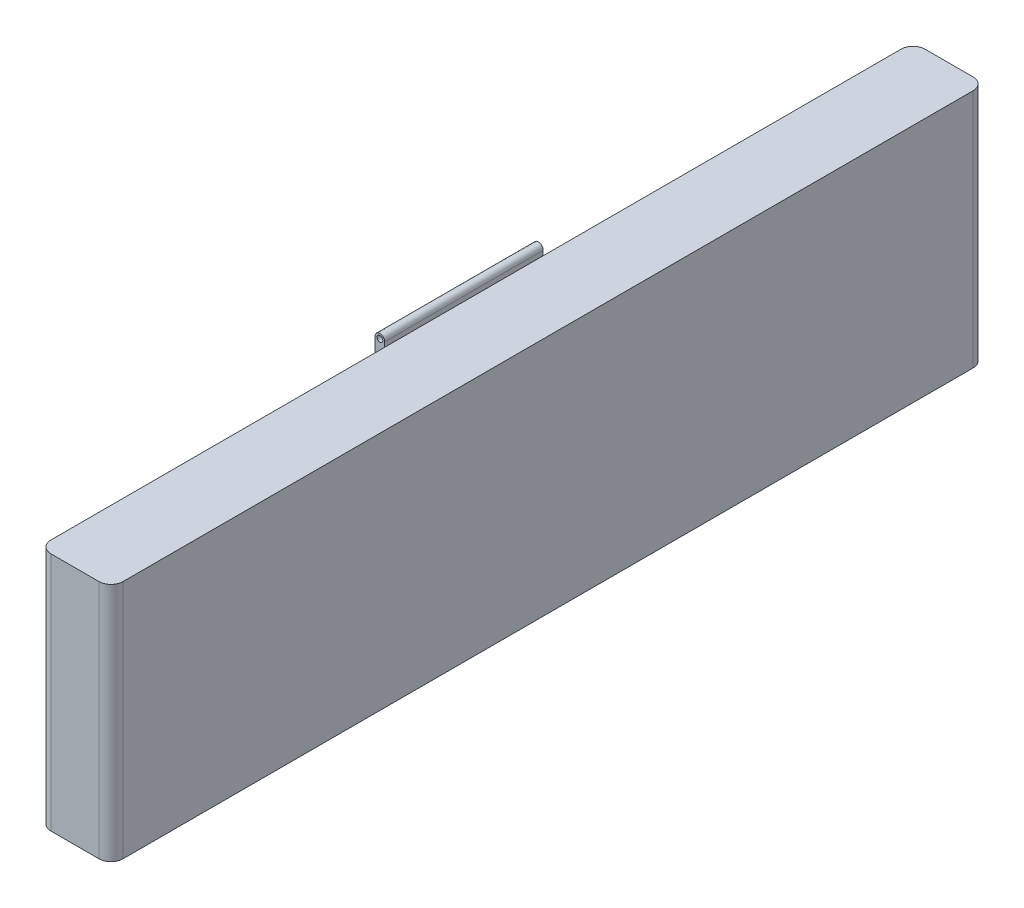
ISO-10303-21;
HEADER;
FILE_DESCRIPTION(('STEP AP214'),'2;1');
FILE_NAME('part.step','',(''),(''),'','','');
FILE_SCHEMA(('AUTOMOTIVE_DESIGN { 1 0 10303 214 1 1 1 1 }'));
ENDSEC;
DATA;
#1=APPLICATION_CONTEXT('core data for automotive mechanical design processes');
#2=APPLICATION_PROTOCOL_DEFINITION('international standard','automotive_design',2000,#1);
#3=PRODUCT_CONTEXT('',#1,'mechanical');
#4=PRODUCT('Part','Part','',(#3));
#5=PRODUCT_RELATED_PRODUCT_CATEGORY('part','',(#4));
#6=PRODUCT_DEFINITION_FORMATION('','',#4);
#7=PRODUCT_DEFINITION_CONTEXT('part definition',#1,'design');
#8=PRODUCT_DEFINITION('design','',#6,#7);
#9=PRODUCT_DEFINITION_SHAPE('','',#8);
#10=(LENGTH_UNIT() NAMED_UNIT(*) SI_UNIT(.MILLI.,.METRE.));
#11=(NAMED_UNIT(*) PLANE_ANGLE_UNIT() SI_UNIT($,.RADIAN.));
#12=(NAMED_UNIT(*) SI_UNIT($,.STERADIAN.) SOLID_ANGLE_UNIT());
#13=UNCERTAINTY_MEASURE_WITH_UNIT(LENGTH_MEASURE(1.E-05),#10,'distance_accuracy_value','');
#14=(GEOMETRIC_REPRESENTATION_CONTEXT(3) GLOBAL_UNCERTAINTY_ASSIGNED_CONTEXT((#13)) GLOBAL_UNIT_ASSIGNED_CONTEXT((#10,
#11,#12)) REPRESENTATION_CONTEXT('',''));
#15=CARTESIAN_POINT('',(0.,0.,0.));
#16=DIRECTION('',(0.,0.,1.));
#17=DIRECTION('',(1.,0.,0.));
#18=AXIS2_PLACEMENT_3D('',#15,#16,#17);
#19=CARTESIAN_POINT('',(0.,0.,0.));
#20=DIRECTION('',(1.,0.,0.));
#21=DIRECTION('',(0.,0.,-1.));
#22=AXIS2_PLACEMENT_3D('',#19,#20,#21);
#23=PLANE('',#22);
#24=CARTESIAN_POINT('',(0.,2.5,11.));
#25=DIRECTION('',(1.,0.,0.));
#26=DIRECTION('',(0.,0.,-1.));
#27=AXIS2_PLACEMENT_3D('',#24,#25,#26);
#28=CIRCLE('',#27,0.6);
#29=CARTESIAN_POINT('',(0.,2.5,10.4));
#30=VERTEX_POINT('',#29);
#31=EDGE_CURVE('E326',#30,#30,#28,.T.);
#32=ORIENTED_EDGE('',*,*,#31,.T.);
#33=EDGE_LOOP('',(#32));
#34=FACE_BOUND('',#33,.T.);
#35=DIRECTION('',(0.,0.,-1.));
#36=VECTOR('',#35,1.);
#37=CARTESIAN_POINT('',(0.,2.8,9.5));
#38=LINE('',#37,#36);
#39=CARTESIAN_POINT('',(0.,2.8,9.5));
#40=VERTEX_POINT('',#39);
#41=CARTESIAN_POINT('',(0.,2.8,5.9));
#42=VERTEX_POINT('',#41);
#43=EDGE_CURVE('E301',#40,#42,#38,.T.);
#44=ORIENTED_EDGE('',*,*,#43,.F.);
#45=DIRECTION('',(0.,1.,0.));
#46=VECTOR('',#45,1.);
#47=CARTESIAN_POINT('',(0.,2.2,9.5));
#48=LINE('',#47,#46);
#49=CARTESIAN_POINT('',(0.,2.2,9.5));
#50=VERTEX_POINT('',#49);
#51=EDGE_CURVE('E285',#50,#40,#48,.T.);
#52=ORIENTED_EDGE('',*,*,#51,.F.);
#53=DIRECTION('',(0.,0.,1.));
#54=VECTOR('',#53,1.);
#55=CARTESIAN_POINT('',(0.,2.2,5.9));
#56=LINE('',#55,#54);
#57=CARTESIAN_POINT('',(0.,2.2,5.9));
#58=VERTEX_POINT('',#57);
#59=EDGE_CURVE('E290',#58,#50,#56,.T.);
#60=ORIENTED_EDGE('',*,*,#59,.F.);
#61=DIRECTION('',(0.,-1.,0.));
#62=VECTOR('',#61,1.);
#63=CARTESIAN_POINT('',(0.,2.8,5.9));
#64=LINE('',#63,#62);
#65=EDGE_CURVE('E304',#42,#58,#64,.T.);
#66=ORIENTED_EDGE('',*,*,#65,.F.);
#67=EDGE_LOOP('',(#44,#52,#60,#66));
#68=FACE_BOUND('',#67,.T.);
#69=DIRECTION('',(0.,0.,1.));
#70=VECTOR('',#69,1.);
#71=CARTESIAN_POINT('',(0.,5.,0.));
#72=LINE('',#71,#70);
#73=CARTESIAN_POINT('',(0.,5.,0.25));
#74=VERTEX_POINT('',#73);
#75=CARTESIAN_POINT('',(0.,5.,7.7));
#76=VERTEX_POINT('',#75);
#77=EDGE_CURVE('E334',#74,#76,#72,.T.);
#78=ORIENTED_EDGE('',*,*,#77,.F.);
#79=DIRECTION('',(0.,1.,0.));
#80=VECTOR('',#79,1.);
#81=CARTESIAN_POINT('',(0.,0.,0.25));
#82=LINE('',#81,#80);
#83=CARTESIAN_POINT('',(0.,0.,0.25));
#84=VERTEX_POINT('',#83);
#85=EDGE_CURVE('E376',#74,#84,#82,.F.);
#86=ORIENTED_EDGE('',*,*,#85,.T.);
#87=DIRECTION('',(0.,0.,-1.));
#88=VECTOR('',#87,1.);
#89=CARTESIAN_POINT('',(0.,0.,18.2));
#90=LINE('',#89,#88);
#91=CARTESIAN_POINT('',(0.,0.,7.7));
#92=VERTEX_POINT('',#91);
#93=EDGE_CURVE('E329',#92,#84,#90,.T.);
#94=ORIENTED_EDGE('',*,*,#93,.F.);
#95=DIRECTION('',(0.,1.,0.));
#96=VECTOR('',#95,1.);
#97=CARTESIAN_POINT('',(0.,0.400000000000003,7.7));
#98=LINE('',#97,#96);
#99=CARTESIAN_POINT('',(0.,0.400000000000003,7.7));
#100=VERTEX_POINT('',#99);
#101=EDGE_CURVE('E230',#92,#100,#98,.T.);
#102=ORIENTED_EDGE('',*,*,#101,.T.);
#103=DIRECTION('',(0.,0.,1.));
#104=VECTOR('',#103,1.);
#105=CARTESIAN_POINT('',(0.,0.400000000000002,11.));
#106=LINE('',#105,#104);
#107=CARTESIAN_POINT('',(0.,0.400000000000002,11.));
#108=VERTEX_POINT('',#107);
#109=EDGE_CURVE('E240',#100,#108,#106,.T.);
#110=ORIENTED_EDGE('',*,*,#109,.T.);
#111=DIRECTION('',(0.,-1.,0.));
#112=VECTOR('',#111,1.);
#113=CARTESIAN_POINT('',(0.,-0.0999999999999985,11.));
#114=LINE('',#113,#112);
#115=CARTESIAN_POINT('',(0.,0.,11.));
#116=VERTEX_POINT('',#115);
#117=EDGE_CURVE('E237',#108,#116,#114,.T.);
#118=ORIENTED_EDGE('',*,*,#117,.T.);
#119=CARTESIAN_POINT('',(0.,0.,17.95));
#120=VERTEX_POINT('',#119);
#121=EDGE_CURVE('E338',#120,#116,#90,.T.);
#122=ORIENTED_EDGE('',*,*,#121,.F.);
#123=DIRECTION('',(0.,-1.,0.));
#124=VECTOR('',#123,1.);
#125=CARTESIAN_POINT('',(0.,0.,17.95));
#126=LINE('',#125,#124);
#127=CARTESIAN_POINT('',(0.,5.,17.95));
#128=VERTEX_POINT('',#127);
#129=EDGE_CURVE('E374',#120,#128,#126,.F.);
#130=ORIENTED_EDGE('',*,*,#129,.T.);
#131=CARTESIAN_POINT('',(0.,5.,11.));
#132=VERTEX_POINT('',#131);
#133=EDGE_CURVE('E340',#132,#128,#72,.T.);
#134=ORIENTED_EDGE('',*,*,#133,.F.);
#135=DIRECTION('',(0.,1.,0.));
#136=VECTOR('',#135,1.);
#137=CARTESIAN_POINT('',(0.,5.1,11.));
#138=LINE('',#137,#136);
#139=CARTESIAN_POINT('',(0.,4.6,11.));
#140=VERTEX_POINT('',#139);
#141=EDGE_CURVE('E261',#140,#132,#138,.T.);
#142=ORIENTED_EDGE('',*,*,#141,.F.);
#143=DIRECTION('',(0.,0.,1.));
#144=VECTOR('',#143,1.);
#145=CARTESIAN_POINT('',(0.,4.6,11.));
#146=LINE('',#145,#144);
#147=CARTESIAN_POINT('',(0.,4.6,7.7));
#148=VERTEX_POINT('',#147);
#149=EDGE_CURVE('E274',#148,#140,#146,.T.);
#150=ORIENTED_EDGE('',*,*,#149,.F.);
#151=DIRECTION('',(0.,-1.,0.));
#152=VECTOR('',#151,1.);
#153=CARTESIAN_POINT('',(0.,0.,7.7));
#154=LINE('',#153,#152);
#155=EDGE_CURVE('E354',#76,#148,#154,.T.);
#156=ORIENTED_EDGE('',*,*,#155,.F.);
#157=EDGE_LOOP('',(#78,#86,#94,#102,#110,#118,#122,#130,#134,#142,#150,#156));
#158=FACE_BOUND('',#157,.T.);
#159=ADVANCED_FACE('F51',(#34,#68,#158),#23,.F.);
#160=CARTESIAN_POINT('',(1.5,0.,18.2));
#161=DIRECTION('',(0.,1.,0.));
#162=DIRECTION('',(0.,0.,1.));
#163=AXIS2_PLACEMENT_3D('',#160,#161,#162);
#164=PLANE('',#163);
#165=ORIENTED_EDGE('',*,*,#93,.T.);
#166=CARTESIAN_POINT('',(0.25,0.,0.25));
#167=DIRECTION('',(0.,1.,0.));
#168=DIRECTION('',(0.,0.,1.));
#169=AXIS2_PLACEMENT_3D('',#166,#167,#168);
#170=CIRCLE('',#169,0.25);
#171=CARTESIAN_POINT('',(0.25,0.,0.));
#172=VERTEX_POINT('',#171);
#173=EDGE_CURVE('E382',#84,#172,#170,.F.);
#174=ORIENTED_EDGE('',*,*,#173,.T.);
#175=DIRECTION('',(-1.,0.,0.));
#176=VECTOR('',#175,1.);
#177=CARTESIAN_POINT('',(1.5,0.,0.));
#178=LINE('',#177,#176);
#179=CARTESIAN_POINT('',(1.25,0.,0.));
#180=VERTEX_POINT('',#179);
#181=EDGE_CURVE('E351',#180,#172,#178,.T.);
#182=ORIENTED_EDGE('',*,*,#181,.F.);
#183=CARTESIAN_POINT('',(1.25,0.,0.25));
#184=DIRECTION('',(0.,1.,0.));
#185=DIRECTION('',(0.,0.,1.));
#186=AXIS2_PLACEMENT_3D('',#183,#184,#185);
#187=CIRCLE('',#186,0.25);
#188=CARTESIAN_POINT('',(1.5,0.,0.25));
#189=VERTEX_POINT('',#188);
#190=EDGE_CURVE('E380',#180,#189,#187,.F.);
#191=ORIENTED_EDGE('',*,*,#190,.T.);
#192=DIRECTION('',(0.,0.,-1.));
#193=VECTOR('',#192,1.);
#194=CARTESIAN_POINT('',(1.5,0.,18.2));
#195=LINE('',#194,#193);
#196=CARTESIAN_POINT('',(1.5,0.,17.95));
#197=VERTEX_POINT('',#196);
#198=EDGE_CURVE('E330',#197,#189,#195,.T.);
#199=ORIENTED_EDGE('',*,*,#198,.F.);
#200=CARTESIAN_POINT('',(1.25,0.,17.95));
#201=DIRECTION('',(0.,1.,0.));
#202=DIRECTION('',(0.,0.,1.));
#203=AXIS2_PLACEMENT_3D('',#200,#201,#202);
#204=CIRCLE('',#203,0.25);
#205=CARTESIAN_POINT('',(1.25,0.,18.2));
#206=VERTEX_POINT('',#205);
#207=EDGE_CURVE('E73',#197,#206,#204,.F.);
#208=ORIENTED_EDGE('',*,*,#207,.T.);
#209=DIRECTION('',(-1.,0.,0.));
#210=VECTOR('',#209,1.);
#211=CARTESIAN_POINT('',(1.5,0.,18.2));
#212=LINE('',#211,#210);
#213=CARTESIAN_POINT('',(0.25,0.,18.2));
#214=VERTEX_POINT('',#213);
#215=EDGE_CURVE('E337',#206,#214,#212,.T.);
#216=ORIENTED_EDGE('',*,*,#215,.T.);
#217=CARTESIAN_POINT('',(0.25,0.,17.95));
#218=DIRECTION('',(0.,1.,0.));
#219=DIRECTION('',(0.,0.,1.));
#220=AXIS2_PLACEMENT_3D('',#217,#218,#219);
#221=CIRCLE('',#220,0.25);
#222=EDGE_CURVE('E66',#214,#120,#221,.F.);
#223=ORIENTED_EDGE('',*,*,#222,.T.);
#224=ORIENTED_EDGE('',*,*,#121,.T.);
#225=EDGE_CURVE('E341',#116,#92,#90,.T.);
#226=ORIENTED_EDGE('',*,*,#225,.T.);
#227=EDGE_LOOP('',(#165,#174,#182,#191,#199,#208,#216,#223,#224,#226));
#228=FACE_BOUND('',#227,.T.);
#229=ADVANCED_FACE('F405',(#228),#164,.F.);
#230=CARTESIAN_POINT('',(1.5,0.,0.));
#231=DIRECTION('',(0.,0.,1.));
#232=DIRECTION('',(1.,0.,0.));
#233=AXIS2_PLACEMENT_3D('',#230,#231,#232);
#234=PLANE('',#233);
#235=ORIENTED_EDGE('',*,*,#181,.T.);
#236=DIRECTION('',(0.,1.,0.));
#237=VECTOR('',#236,1.);
#238=CARTESIAN_POINT('',(0.25,0.,0.));
#239=LINE('',#238,#237);
#240=CARTESIAN_POINT('',(0.25,5.,0.));
#241=VERTEX_POINT('',#240);
#242=EDGE_CURVE('E363',#172,#241,#239,.T.);
#243=ORIENTED_EDGE('',*,*,#242,.T.);
#244=DIRECTION('',(-1.,0.,0.));
#245=VECTOR('',#244,1.);
#246=CARTESIAN_POINT('',(1.5,5.,0.));
#247=LINE('',#246,#245);
#248=CARTESIAN_POINT('',(1.25,5.,0.));
#249=VERTEX_POINT('',#248);
#250=EDGE_CURVE('E348',#249,#241,#247,.T.);
#251=ORIENTED_EDGE('',*,*,#250,.F.);
#252=DIRECTION('',(0.,1.,0.));
#253=VECTOR('',#252,1.);
#254=CARTESIAN_POINT('',(1.25,0.,0.));
#255=LINE('',#254,#253);
#256=EDGE_CURVE('E357',#249,#180,#255,.F.);
#257=ORIENTED_EDGE('',*,*,#256,.T.);
#258=EDGE_LOOP('',(#235,#243,#251,#257));
#259=FACE_BOUND('',#258,.T.);
#260=ADVANCED_FACE('F413',(#259),#234,.F.);
#261=CARTESIAN_POINT('',(1.5,5.,0.));
#262=DIRECTION('',(0.,-1.,0.));
#263=DIRECTION('',(0.,0.,-1.));
#264=AXIS2_PLACEMENT_3D('',#261,#262,#263);
#265=PLANE('',#264);
#266=ORIENTED_EDGE('',*,*,#250,.T.);
#267=CARTESIAN_POINT('',(0.25,5.,0.25));
#268=DIRECTION('',(0.,-1.,0.));
#269=DIRECTION('',(0.,0.,-1.));
#270=AXIS2_PLACEMENT_3D('',#267,#268,#269);
#271=CIRCLE('',#270,0.25);
#272=EDGE_CURVE('E372',#241,#74,#271,.F.);
#273=ORIENTED_EDGE('',*,*,#272,.T.);
#274=ORIENTED_EDGE('',*,*,#77,.T.);
#275=EDGE_CURVE('E343',#76,#132,#72,.T.);
#276=ORIENTED_EDGE('',*,*,#275,.T.);
#277=ORIENTED_EDGE('',*,*,#133,.T.);
#278=CARTESIAN_POINT('',(0.25,5.,17.95));
#279=DIRECTION('',(0.,-1.,0.));
#280=DIRECTION('',(0.,0.,-1.));
#281=AXIS2_PLACEMENT_3D('',#278,#279,#280);
#282=CIRCLE('',#281,0.25);
#283=CARTESIAN_POINT('',(0.25,5.,18.2));
#284=VERTEX_POINT('',#283);
#285=EDGE_CURVE('E368',#128,#284,#282,.F.);
#286=ORIENTED_EDGE('',*,*,#285,.T.);
#287=DIRECTION('',(-1.,0.,0.));
#288=VECTOR('',#287,1.);
#289=CARTESIAN_POINT('',(1.5,5.,18.2));
#290=LINE('',#289,#288);
#291=CARTESIAN_POINT('',(1.25,5.,18.2));
#292=VERTEX_POINT('',#291);
#293=EDGE_CURVE('E345',#292,#284,#290,.T.);
#294=ORIENTED_EDGE('',*,*,#293,.F.);
#295=CARTESIAN_POINT('',(1.25,5.,17.95));
#296=DIRECTION('',(0.,-1.,0.));
#297=DIRECTION('',(0.,0.,-1.));
#298=AXIS2_PLACEMENT_3D('',#295,#296,#297);
#299=CIRCLE('',#298,0.25);
#300=CARTESIAN_POINT('',(1.5,5.,17.95));
#301=VERTEX_POINT('',#300);
#302=EDGE_CURVE('E366',#292,#301,#299,.F.);
#303=ORIENTED_EDGE('',*,*,#302,.T.);
#304=DIRECTION('',(0.,0.,1.));
#305=VECTOR('',#304,1.);
#306=CARTESIAN_POINT('',(1.5,5.,0.));
#307=LINE('',#306,#305);
#308=CARTESIAN_POINT('',(1.5,5.,0.25));
#309=VERTEX_POINT('',#308);
#310=EDGE_CURVE('E333',#309,#301,#307,.T.);
#311=ORIENTED_EDGE('',*,*,#310,.F.);
#312=CARTESIAN_POINT('',(1.25,5.,0.25));
#313=DIRECTION('',(0.,-1.,0.));
#314=DIRECTION('',(0.,0.,-1.));
#315=AXIS2_PLACEMENT_3D('',#312,#313,#314);
#316=CIRCLE('',#315,0.25);
#317=EDGE_CURVE('E370',#309,#249,#316,.F.);
#318=ORIENTED_EDGE('',*,*,#317,.T.);
#319=EDGE_LOOP('',(#266,#273,#274,#276,#277,#286,#294,#303,#311,#318));
#320=FACE_BOUND('',#319,.T.);
#321=ADVANCED_FACE('F396',(#320),#265,.F.);
#322=CARTESIAN_POINT('',(1.5,5.,18.2));
#323=DIRECTION('',(0.,0.,-1.));
#324=DIRECTION('',(-1.,0.,0.));
#325=AXIS2_PLACEMENT_3D('',#322,#323,#324);
#326=PLANE('',#325);
#327=ORIENTED_EDGE('',*,*,#293,.T.);
#328=DIRECTION('',(0.,-1.,0.));
#329=VECTOR('',#328,1.);
#330=CARTESIAN_POINT('',(0.25,5.,18.2));
#331=LINE('',#330,#329);
#332=EDGE_CURVE('E13',#284,#214,#331,.T.);
#333=ORIENTED_EDGE('',*,*,#332,.T.);
#334=ORIENTED_EDGE('',*,*,#215,.F.);
#335=DIRECTION('',(0.,-1.,0.));
#336=VECTOR('',#335,1.);
#337=CARTESIAN_POINT('',(1.25,5.,18.2));
#338=LINE('',#337,#336);
#339=EDGE_CURVE('E59',#206,#292,#338,.F.);
#340=ORIENTED_EDGE('',*,*,#339,.T.);
#341=EDGE_LOOP('',(#327,#333,#334,#340));
#342=FACE_BOUND('',#341,.T.);
#343=ADVANCED_FACE('F392',(#342),#326,.F.);
#344=CARTESIAN_POINT('',(1.5,0.,0.));
#345=DIRECTION('',(1.,0.,0.));
#346=DIRECTION('',(0.,0.,-1.));
#347=AXIS2_PLACEMENT_3D('',#344,#345,#346);
#348=PLANE('',#347);
#349=ORIENTED_EDGE('',*,*,#198,.T.);
#350=DIRECTION('',(0.,1.,0.));
#351=VECTOR('',#350,1.);
#352=CARTESIAN_POINT('',(1.5,5.,0.25));
#353=LINE('',#352,#351);
#354=EDGE_CURVE('E387',#189,#309,#353,.T.);
#355=ORIENTED_EDGE('',*,*,#354,.T.);
#356=ORIENTED_EDGE('',*,*,#310,.T.);
#357=DIRECTION('',(0.,-1.,0.));
#358=VECTOR('',#357,1.);
#359=CARTESIAN_POINT('',(1.5,0.,17.95));
#360=LINE('',#359,#358);
#361=EDGE_CURVE('E384',#301,#197,#360,.T.);
#362=ORIENTED_EDGE('',*,*,#361,.T.);
#363=EDGE_LOOP('',(#349,#355,#356,#362));
#364=FACE_BOUND('',#363,.T.);
#365=ADVANCED_FACE('F402',(#364),#348,.T.);
#366=CARTESIAN_POINT('',(0.,2.5,11.));
#367=DIRECTION('',(1.,0.,0.));
#368=DIRECTION('',(0.,0.,-1.));
#369=AXIS2_PLACEMENT_3D('',#366,#367,#368);
#370=CYLINDRICAL_SURFACE('',#369,0.6);
#371=CARTESIAN_POINT('',(-0.3,2.5,11.));
#372=DIRECTION('',(1.,0.,0.));
#373=DIRECTION('',(0.,0.,-1.));
#374=AXIS2_PLACEMENT_3D('',#371,#372,#373);
#375=CIRCLE('',#374,0.6);
#376=CARTESIAN_POINT('',(-0.3,2.5,10.4));
#377=VERTEX_POINT('',#376);
#378=EDGE_CURVE('E323',#377,#377,#375,.T.);
#379=ORIENTED_EDGE('',*,*,#378,.T.);
#380=EDGE_LOOP('',(#379));
#381=FACE_BOUND('',#380,.T.);
#382=ORIENTED_EDGE('',*,*,#31,.F.);
#383=EDGE_LOOP('',(#382));
#384=FACE_BOUND('',#383,.T.);
#385=ADVANCED_FACE('F556',(#381,#384),#370,.T.);
#386=CARTESIAN_POINT('',(-0.3,3.1,11.));
#387=DIRECTION('',(-1.,0.,0.));
#388=DIRECTION('',(0.,0.,1.));
#389=AXIS2_PLACEMENT_3D('',#386,#387,#388);
#390=PLANE('',#389);
#391=CARTESIAN_POINT('',(-0.3,2.5,11.));
#392=DIRECTION('',(1.,0.,0.));
#393=DIRECTION('',(0.,0.,-1.));
#394=AXIS2_PLACEMENT_3D('',#391,#392,#393);
#395=CIRCLE('',#394,0.3);
#396=CARTESIAN_POINT('',(-0.3,2.5,10.7));
#397=VERTEX_POINT('',#396);
#398=EDGE_CURVE('E320',#397,#397,#395,.T.);
#399=ORIENTED_EDGE('',*,*,#398,.T.);
#400=EDGE_LOOP('',(#399));
#401=FACE_BOUND('',#400,.T.);
#402=ORIENTED_EDGE('',*,*,#378,.F.);
#403=EDGE_LOOP('',(#402));
#404=FACE_BOUND('',#403,.T.);
#405=ADVANCED_FACE('F553',(#401,#404),#390,.T.);
#406=CARTESIAN_POINT('',(0.,2.5,11.));
#407=DIRECTION('',(1.,0.,0.));
#408=DIRECTION('',(0.,0.,-1.));
#409=AXIS2_PLACEMENT_3D('',#406,#407,#408);
#410=CYLINDRICAL_SURFACE('',#409,0.3);
#411=CARTESIAN_POINT('',(-0.6,2.5,11.));
#412=DIRECTION('',(1.,0.,0.));
#413=DIRECTION('',(0.,0.,-1.));
#414=AXIS2_PLACEMENT_3D('',#411,#412,#413);
#415=CIRCLE('',#414,0.3);
#416=CARTESIAN_POINT('',(-0.6,2.5,10.7));
#417=VERTEX_POINT('',#416);
#418=EDGE_CURVE('E311',#417,#417,#415,.T.);
#419=ORIENTED_EDGE('',*,*,#418,.T.);
#420=EDGE_LOOP('',(#419));
#421=FACE_BOUND('',#420,.T.);
#422=ORIENTED_EDGE('',*,*,#398,.F.);
#423=EDGE_LOOP('',(#422));
#424=FACE_BOUND('',#423,.T.);
#425=ADVANCED_FACE('F549',(#421,#424),#410,.T.);
#426=CARTESIAN_POINT('',(-0.6,2.8,11.));
#427=DIRECTION('',(-1.,0.,0.));
#428=DIRECTION('',(0.,0.,1.));
#429=AXIS2_PLACEMENT_3D('',#426,#427,#428);
#430=PLANE('',#429);
#431=ORIENTED_EDGE('',*,*,#418,.F.);
#432=EDGE_LOOP('',(#431));
#433=FACE_BOUND('',#432,.T.);
#434=ADVANCED_FACE('F545',(#433),#430,.T.);
#435=CARTESIAN_POINT('',(0.6,2.2,9.5));
#436=DIRECTION('',(0.,0.,1.));
#437=DIRECTION('',(1.,0.,0.));
#438=AXIS2_PLACEMENT_3D('',#435,#436,#437);
#439=PLANE('',#438);
#440=ORIENTED_EDGE('',*,*,#51,.T.);
#441=DIRECTION('',(-1.,0.,0.));
#442=VECTOR('',#441,1.);
#443=CARTESIAN_POINT('',(0.6,2.8,9.5));
#444=LINE('',#443,#442);
#445=CARTESIAN_POINT('',(0.6,2.8,9.5));
#446=VERTEX_POINT('',#445);
#447=EDGE_CURVE('E299',#446,#40,#444,.T.);
#448=ORIENTED_EDGE('',*,*,#447,.F.);
#449=DIRECTION('',(0.,1.,0.));
#450=VECTOR('',#449,1.);
#451=CARTESIAN_POINT('',(0.6,2.2,9.5));
#452=LINE('',#451,#450);
#453=CARTESIAN_POINT('',(0.6,2.2,9.5));
#454=VERTEX_POINT('',#453);
#455=EDGE_CURVE('E286',#454,#446,#452,.T.);
#456=ORIENTED_EDGE('',*,*,#455,.F.);
#457=DIRECTION('',(-1.,0.,0.));
#458=VECTOR('',#457,1.);
#459=CARTESIAN_POINT('',(0.6,2.2,9.5));
#460=LINE('',#459,#458);
#461=EDGE_CURVE('E309',#454,#50,#460,.T.);
#462=ORIENTED_EDGE('',*,*,#461,.T.);
#463=EDGE_LOOP('',(#440,#448,#456,#462));
#464=FACE_BOUND('',#463,.T.);
#465=ADVANCED_FACE('F535',(#464),#439,.F.);
#466=CARTESIAN_POINT('',(0.6,2.2,5.9));
#467=DIRECTION('',(0.,-1.,0.));
#468=DIRECTION('',(0.,0.,-1.));
#469=AXIS2_PLACEMENT_3D('',#466,#467,#468);
#470=PLANE('',#469);
#471=ORIENTED_EDGE('',*,*,#59,.T.);
#472=ORIENTED_EDGE('',*,*,#461,.F.);
#473=DIRECTION('',(0.,0.,1.));
#474=VECTOR('',#473,1.);
#475=CARTESIAN_POINT('',(0.6,2.2,5.9));
#476=LINE('',#475,#474);
#477=CARTESIAN_POINT('',(0.6,2.2,5.9));
#478=VERTEX_POINT('',#477);
#479=EDGE_CURVE('E296',#478,#454,#476,.T.);
#480=ORIENTED_EDGE('',*,*,#479,.F.);
#481=DIRECTION('',(-1.,0.,0.));
#482=VECTOR('',#481,1.);
#483=CARTESIAN_POINT('',(0.6,2.2,5.9));
#484=LINE('',#483,#482);
#485=EDGE_CURVE('E312',#478,#58,#484,.T.);
#486=ORIENTED_EDGE('',*,*,#485,.T.);
#487=EDGE_LOOP('',(#471,#472,#480,#486));
#488=FACE_BOUND('',#487,.T.);
#489=ADVANCED_FACE('F531',(#488),#470,.F.);
#490=CARTESIAN_POINT('',(0.6,2.8,5.9));
#491=DIRECTION('',(0.,0.,-1.));
#492=DIRECTION('',(-1.,0.,0.));
#493=AXIS2_PLACEMENT_3D('',#490,#491,#492);
#494=PLANE('',#493);
#495=ORIENTED_EDGE('',*,*,#65,.T.);
#496=ORIENTED_EDGE('',*,*,#485,.F.);
#497=DIRECTION('',(0.,-1.,0.));
#498=VECTOR('',#497,1.);
#499=CARTESIAN_POINT('',(0.6,2.8,5.9));
#500=LINE('',#499,#498);
#501=CARTESIAN_POINT('',(0.6,2.8,5.9));
#502=VERTEX_POINT('',#501);
#503=EDGE_CURVE('E293',#502,#478,#500,.T.);
#504=ORIENTED_EDGE('',*,*,#503,.F.);
#505=DIRECTION('',(-1.,0.,0.));
#506=VECTOR('',#505,1.);
#507=CARTESIAN_POINT('',(0.6,2.8,5.9));
#508=LINE('',#507,#506);
#509=EDGE_CURVE('E314',#502,#42,#508,.T.);
#510=ORIENTED_EDGE('',*,*,#509,.T.);
#511=EDGE_LOOP('',(#495,#496,#504,#510));
#512=FACE_BOUND('',#511,.T.);
#513=ADVANCED_FACE('F534',(#512),#494,.F.);
#514=CARTESIAN_POINT('',(0.6,2.8,9.5));
#515=DIRECTION('',(0.,1.,0.));
#516=DIRECTION('',(0.,0.,1.));
#517=AXIS2_PLACEMENT_3D('',#514,#515,#516);
#518=PLANE('',#517);
#519=ORIENTED_EDGE('',*,*,#43,.T.);
#520=ORIENTED_EDGE('',*,*,#509,.F.);
#521=DIRECTION('',(0.,0.,-1.));
#522=VECTOR('',#521,1.);
#523=CARTESIAN_POINT('',(0.6,2.8,9.5));
#524=LINE('',#523,#522);
#525=EDGE_CURVE('E289',#446,#502,#524,.T.);
#526=ORIENTED_EDGE('',*,*,#525,.F.);
#527=ORIENTED_EDGE('',*,*,#447,.T.);
#528=EDGE_LOOP('',(#519,#520,#526,#527));
#529=FACE_BOUND('',#528,.T.);
#530=ADVANCED_FACE('F529',(#529),#518,.F.);
#531=CARTESIAN_POINT('',(0.6,0.,0.));
#532=DIRECTION('',(-1.,0.,0.));
#533=DIRECTION('',(0.,0.,1.));
#534=AXIS2_PLACEMENT_3D('',#531,#532,#533);
#535=PLANE('',#534);
#536=ORIENTED_EDGE('',*,*,#455,.T.);
#537=ORIENTED_EDGE('',*,*,#525,.T.);
#538=ORIENTED_EDGE('',*,*,#503,.T.);
#539=ORIENTED_EDGE('',*,*,#479,.T.);
#540=EDGE_LOOP('',(#536,#537,#538,#539));
#541=FACE_BOUND('',#540,.T.);
#542=ADVANCED_FACE('F525',(#541),#535,.T.);
#543=CARTESIAN_POINT('',(0.,0.,0.));
#544=DIRECTION('',(1.,0.,0.));
#545=DIRECTION('',(0.,0.,-1.));
#546=AXIS2_PLACEMENT_3D('',#543,#544,#545);
#547=PLANE('',#546);
#548=ORIENTED_EDGE('',*,*,#275,.F.);
#549=DIRECTION('',(0.,-1.,0.));
#550=VECTOR('',#549,1.);
#551=CARTESIAN_POINT('',(0.,4.6,7.7));
#552=LINE('',#551,#550);
#553=CARTESIAN_POINT('',(0.,5.1,7.7));
#554=VERTEX_POINT('',#553);
#555=EDGE_CURVE('E271',#554,#76,#552,.T.);
#556=ORIENTED_EDGE('',*,*,#555,.F.);
#557=DIRECTION('',(0.,0.,-1.));
#558=VECTOR('',#557,1.);
#559=CARTESIAN_POINT('',(0.,5.1,7.7));
#560=LINE('',#559,#558);
#561=CARTESIAN_POINT('',(0.,5.1,11.));
#562=VERTEX_POINT('',#561);
#563=EDGE_CURVE('E255',#562,#554,#560,.T.);
#564=ORIENTED_EDGE('',*,*,#563,.F.);
#565=EDGE_CURVE('E277',#132,#562,#138,.T.);
#566=ORIENTED_EDGE('',*,*,#565,.F.);
#567=EDGE_LOOP('',(#548,#556,#564,#566));
#568=FACE_BOUND('',#567,.T.);
#569=ADVANCED_FACE('F429',(#568),#547,.T.);
#570=CARTESIAN_POINT('',(-0.2,4.6,7.7));
#571=DIRECTION('',(0.,0.,1.));
#572=DIRECTION('',(1.,0.,0.));
#573=AXIS2_PLACEMENT_3D('',#570,#571,#572);
#574=PLANE('',#573);
#575=CARTESIAN_POINT('',(-0.1,5.1,7.7));
#576=DIRECTION('',(0.,0.,1.));
#577=DIRECTION('',(1.,0.,0.));
#578=AXIS2_PLACEMENT_3D('',#575,#576,#577);
#579=CIRCLE('',#578,0.0599999999999999);
#580=CARTESIAN_POINT('',(-0.0400000000000004,5.1,7.7));
#581=VERTEX_POINT('',#580);
#582=EDGE_CURVE('E249',#581,#581,#579,.T.);
#583=ORIENTED_EDGE('',*,*,#582,.T.);
#584=EDGE_LOOP('',(#583));
#585=FACE_BOUND('',#584,.T.);
#586=ORIENTED_EDGE('',*,*,#555,.T.);
#587=ORIENTED_EDGE('',*,*,#155,.T.);
#588=DIRECTION('',(1.,0.,0.));
#589=VECTOR('',#588,1.);
#590=CARTESIAN_POINT('',(-0.2,4.6,7.7));
#591=LINE('',#590,#589);
#592=CARTESIAN_POINT('',(-0.2,4.6,7.7));
#593=VERTEX_POINT('',#592);
#594=EDGE_CURVE('E282',#593,#148,#591,.T.);
#595=ORIENTED_EDGE('',*,*,#594,.F.);
#596=DIRECTION('',(0.,-1.,0.));
#597=VECTOR('',#596,1.);
#598=CARTESIAN_POINT('',(-0.2,4.6,7.7));
#599=LINE('',#598,#597);
#600=CARTESIAN_POINT('',(-0.2,5.1,7.7));
#601=VERTEX_POINT('',#600);
#602=EDGE_CURVE('E260',#601,#593,#599,.T.);
#603=ORIENTED_EDGE('',*,*,#602,.F.);
#604=CARTESIAN_POINT('',(-0.1,5.1,7.7));
#605=DIRECTION('',(0.,0.,1.));
#606=DIRECTION('',(1.,0.,0.));
#607=AXIS2_PLACEMENT_3D('',#604,#605,#606);
#608=CIRCLE('',#607,0.1);
#609=EDGE_CURVE('E253',#554,#601,#608,.T.);
#610=ORIENTED_EDGE('',*,*,#609,.F.);
#611=EDGE_LOOP('',(#586,#587,#595,#603,#610));
#612=FACE_BOUND('',#611,.T.);
#613=ADVANCED_FACE('F433',(#585,#612),#574,.F.);
#614=CARTESIAN_POINT('',(-0.2,4.6,11.));
#615=DIRECTION('',(0.,1.,0.));
#616=DIRECTION('',(0.,0.,1.));
#617=AXIS2_PLACEMENT_3D('',#614,#615,#616);
#618=PLANE('',#617);
#619=ORIENTED_EDGE('',*,*,#149,.T.);
#620=DIRECTION('',(1.,0.,0.));
#621=VECTOR('',#620,1.);
#622=CARTESIAN_POINT('',(-0.2,4.6,11.));
#623=LINE('',#622,#621);
#624=CARTESIAN_POINT('',(-0.2,4.6,11.));
#625=VERTEX_POINT('',#624);
#626=EDGE_CURVE('E268',#625,#140,#623,.T.);
#627=ORIENTED_EDGE('',*,*,#626,.F.);
#628=DIRECTION('',(0.,0.,1.));
#629=VECTOR('',#628,1.);
#630=CARTESIAN_POINT('',(-0.2,4.6,11.));
#631=LINE('',#630,#629);
#632=EDGE_CURVE('E263',#593,#625,#631,.T.);
#633=ORIENTED_EDGE('',*,*,#632,.F.);
#634=ORIENTED_EDGE('',*,*,#594,.T.);
#635=EDGE_LOOP('',(#619,#627,#633,#634));
#636=FACE_BOUND('',#635,.T.);
#637=ADVANCED_FACE('F443',(#636),#618,.F.);
#638=CARTESIAN_POINT('',(-0.2,5.1,11.));
#639=DIRECTION('',(0.,0.,-1.));
#640=DIRECTION('',(-1.,0.,0.));
#641=AXIS2_PLACEMENT_3D('',#638,#639,#640);
#642=PLANE('',#641);
#643=CARTESIAN_POINT('',(-0.1,5.1,11.));
#644=DIRECTION('',(0.,0.,1.));
#645=DIRECTION('',(1.,0.,0.));
#646=AXIS2_PLACEMENT_3D('',#643,#644,#645);
#647=CIRCLE('',#646,0.0599999999999999);
#648=CARTESIAN_POINT('',(-0.0400000000000004,5.1,11.));
#649=VERTEX_POINT('',#648);
#650=EDGE_CURVE('E246',#649,#649,#647,.T.);
#651=ORIENTED_EDGE('',*,*,#650,.F.);
#652=EDGE_LOOP('',(#651));
#653=FACE_BOUND('',#652,.T.);
#654=ORIENTED_EDGE('',*,*,#141,.T.);
#655=ORIENTED_EDGE('',*,*,#565,.T.);
#656=CARTESIAN_POINT('',(-0.1,5.1,11.));
#657=DIRECTION('',(0.,0.,-1.));
#658=DIRECTION('',(-1.,0.,0.));
#659=AXIS2_PLACEMENT_3D('',#656,#657,#658);
#660=CIRCLE('',#659,0.1);
#661=CARTESIAN_POINT('',(-0.2,5.1,11.));
#662=VERTEX_POINT('',#661);
#663=EDGE_CURVE('E252',#662,#562,#660,.T.);
#664=ORIENTED_EDGE('',*,*,#663,.F.);
#665=DIRECTION('',(0.,1.,0.));
#666=VECTOR('',#665,1.);
#667=CARTESIAN_POINT('',(-0.2,5.1,11.));
#668=LINE('',#667,#666);
#669=EDGE_CURVE('E265',#625,#662,#668,.T.);
#670=ORIENTED_EDGE('',*,*,#669,.F.);
#671=ORIENTED_EDGE('',*,*,#626,.T.);
#672=EDGE_LOOP('',(#654,#655,#664,#670,#671));
#673=FACE_BOUND('',#672,.T.);
#674=ADVANCED_FACE('F440',(#653,#673),#642,.F.);
#675=CARTESIAN_POINT('',(-0.2,0.,0.));
#676=DIRECTION('',(1.,0.,0.));
#677=DIRECTION('',(0.,0.,-1.));
#678=AXIS2_PLACEMENT_3D('',#675,#676,#677);
#679=PLANE('',#678);
#680=DIRECTION('',(0.,0.,-1.));
#681=VECTOR('',#680,1.);
#682=CARTESIAN_POINT('',(-0.2,5.1,7.7));
#683=LINE('',#682,#681);
#684=EDGE_CURVE('E257',#662,#601,#683,.T.);
#685=ORIENTED_EDGE('',*,*,#684,.T.);
#686=ORIENTED_EDGE('',*,*,#602,.T.);
#687=ORIENTED_EDGE('',*,*,#632,.T.);
#688=ORIENTED_EDGE('',*,*,#669,.T.);
#689=EDGE_LOOP('',(#685,#686,#687,#688));
#690=FACE_BOUND('',#689,.T.);
#691=ADVANCED_FACE('F446',(#690),#679,.F.);
#692=CARTESIAN_POINT('',(-0.1,5.1,7.47639320225002));
#693=DIRECTION('',(0.,0.,1.));
#694=DIRECTION('',(1.,0.,0.));
#695=AXIS2_PLACEMENT_3D('',#692,#693,#694);
#696=CYLINDRICAL_SURFACE('',#695,0.1);
#697=ORIENTED_EDGE('',*,*,#563,.T.);
#698=ORIENTED_EDGE('',*,*,#609,.T.);
#699=ORIENTED_EDGE('',*,*,#684,.F.);
#700=ORIENTED_EDGE('',*,*,#663,.T.);
#701=EDGE_LOOP('',(#697,#698,#699,#700));
#702=FACE_BOUND('',#701,.T.);
#703=ADVANCED_FACE('F436',(#702),#696,.T.);
#704=CARTESIAN_POINT('',(-0.1,5.1,0.));
#705=DIRECTION('',(0.,0.,1.));
#706=DIRECTION('',(1.,0.,0.));
#707=AXIS2_PLACEMENT_3D('',#704,#705,#706);
#708=CYLINDRICAL_SURFACE('',#707,0.0599999999999999);
#709=ORIENTED_EDGE('',*,*,#650,.T.);
#710=EDGE_LOOP('',(#709));
#711=FACE_BOUND('',#710,.T.);
#712=ORIENTED_EDGE('',*,*,#582,.F.);
#713=EDGE_LOOP('',(#712));
#714=FACE_BOUND('',#713,.T.);
#715=ADVANCED_FACE('F453',(#711,#714),#708,.F.);
#716=CARTESIAN_POINT('',(0.,5.,0.));
#717=DIRECTION('',(1.,0.,0.));
#718=DIRECTION('',(0.,0.,-1.));
#719=AXIS2_PLACEMENT_3D('',#716,#717,#718);
#720=PLANE('',#719);
#721=ORIENTED_EDGE('',*,*,#225,.F.);
#722=CARTESIAN_POINT('',(0.,-0.0999999999999985,11.));
#723=VERTEX_POINT('',#722);
#724=EDGE_CURVE('E236',#116,#723,#114,.T.);
#725=ORIENTED_EDGE('',*,*,#724,.T.);
#726=DIRECTION('',(0.,0.,-1.));
#727=VECTOR('',#726,1.);
#728=CARTESIAN_POINT('',(0.,-0.0999999999999994,7.7));
#729=LINE('',#728,#727);
#730=CARTESIAN_POINT('',(0.,-0.0999999999999994,7.7));
#731=VERTEX_POINT('',#730);
#732=EDGE_CURVE('E221',#723,#731,#729,.T.);
#733=ORIENTED_EDGE('',*,*,#732,.T.);
#734=EDGE_CURVE('E218',#731,#92,#98,.T.);
#735=ORIENTED_EDGE('',*,*,#734,.T.);
#736=EDGE_LOOP('',(#721,#725,#733,#735));
#737=FACE_BOUND('',#736,.T.);
#738=ADVANCED_FACE('F494',(#737),#720,.T.);
#739=CARTESIAN_POINT('',(-0.2,-0.0999999999999985,11.));
#740=DIRECTION('',(0.,0.,1.));
#741=DIRECTION('',(1.,0.,0.));
#742=AXIS2_PLACEMENT_3D('',#739,#740,#741);
#743=PLANE('',#742);
#744=CARTESIAN_POINT('',(-0.1,-0.0999999999999985,11.));
#745=DIRECTION('',(0.,0.,-1.));
#746=DIRECTION('',(1.,0.,0.));
#747=AXIS2_PLACEMENT_3D('',#744,#745,#746);
#748=CIRCLE('',#747,0.0599999999999999);
#749=CARTESIAN_POINT('',(-0.0400000000000004,-0.0999999999999985,11.));
#750=VERTEX_POINT('',#749);
#751=EDGE_CURVE('E361',#750,#750,#748,.T.);
#752=ORIENTED_EDGE('',*,*,#751,.T.);
#753=EDGE_LOOP('',(#752));
#754=FACE_BOUND('',#753,.T.);
#755=ORIENTED_EDGE('',*,*,#117,.F.);
#756=DIRECTION('',(1.,0.,0.));
#757=VECTOR('',#756,1.);
#758=CARTESIAN_POINT('',(-0.2,0.400000000000002,11.));
#759=LINE('',#758,#757);
#760=CARTESIAN_POINT('',(-0.2,0.400000000000002,11.));
#761=VERTEX_POINT('',#760);
#762=EDGE_CURVE('E244',#761,#108,#759,.T.);
#763=ORIENTED_EDGE('',*,*,#762,.F.);
#764=DIRECTION('',(0.,-1.,0.));
#765=VECTOR('',#764,1.);
#766=CARTESIAN_POINT('',(-0.2,-0.0999999999999985,11.));
#767=LINE('',#766,#765);
#768=CARTESIAN_POINT('',(-0.2,-0.0999999999999985,11.));
#769=VERTEX_POINT('',#768);
#770=EDGE_CURVE('E227',#761,#769,#767,.T.);
#771=ORIENTED_EDGE('',*,*,#770,.T.);
#772=CARTESIAN_POINT('',(-0.1,-0.0999999999999985,11.));
#773=DIRECTION('',(0.,0.,1.));
#774=DIRECTION('',(-1.,0.,0.));
#775=AXIS2_PLACEMENT_3D('',#772,#773,#774);
#776=CIRCLE('',#775,0.1);
#777=EDGE_CURVE('E222',#769,#723,#776,.T.);
#778=ORIENTED_EDGE('',*,*,#777,.T.);
#779=ORIENTED_EDGE('',*,*,#724,.F.);
#780=EDGE_LOOP('',(#755,#763,#771,#778,#779));
#781=FACE_BOUND('',#780,.T.);
#782=ADVANCED_FACE('F492',(#754,#781),#743,.T.);
#783=CARTESIAN_POINT('',(-0.2,0.400000000000002,11.));
#784=DIRECTION('',(0.,1.,0.));
#785=DIRECTION('',(0.,0.,1.));
#786=AXIS2_PLACEMENT_3D('',#783,#784,#785);
#787=PLANE('',#786);
#788=ORIENTED_EDGE('',*,*,#109,.F.);
#789=DIRECTION('',(1.,0.,0.));
#790=VECTOR('',#789,1.);
#791=CARTESIAN_POINT('',(-0.2,0.400000000000003,7.7));
#792=LINE('',#791,#790);
#793=CARTESIAN_POINT('',(-0.2,0.400000000000003,7.7));
#794=VERTEX_POINT('',#793);
#795=EDGE_CURVE('E211',#794,#100,#792,.T.);
#796=ORIENTED_EDGE('',*,*,#795,.F.);
#797=DIRECTION('',(0.,0.,1.));
#798=VECTOR('',#797,1.);
#799=CARTESIAN_POINT('',(-0.2,0.400000000000002,11.));
#800=LINE('',#799,#798);
#801=EDGE_CURVE('E209',#794,#761,#800,.T.);
#802=ORIENTED_EDGE('',*,*,#801,.T.);
#803=ORIENTED_EDGE('',*,*,#762,.T.);
#804=EDGE_LOOP('',(#788,#796,#802,#803));
#805=FACE_BOUND('',#804,.T.);
#806=ADVANCED_FACE('F496',(#805),#787,.T.);
#807=CARTESIAN_POINT('',(-0.2,0.400000000000003,7.7));
#808=DIRECTION('',(0.,0.,-1.));
#809=DIRECTION('',(-1.,0.,0.));
#810=AXIS2_PLACEMENT_3D('',#807,#808,#809);
#811=PLANE('',#810);
#812=CARTESIAN_POINT('',(-0.1,-0.0999999999999985,7.7));
#813=DIRECTION('',(0.,0.,-1.));
#814=DIRECTION('',(-1.,0.,0.));
#815=AXIS2_PLACEMENT_3D('',#812,#813,#814);
#816=CIRCLE('',#815,0.0599999999999999);
#817=CARTESIAN_POINT('',(-0.16,-0.0999999999999985,7.7));
#818=VERTEX_POINT('',#817);
#819=EDGE_CURVE('E358',#818,#818,#816,.F.);
#820=ORIENTED_EDGE('',*,*,#819,.T.);
#821=EDGE_LOOP('',(#820));
#822=FACE_BOUND('',#821,.T.);
#823=ORIENTED_EDGE('',*,*,#734,.F.);
#824=CARTESIAN_POINT('',(-0.1,-0.0999999999999985,7.7));
#825=DIRECTION('',(0.,0.,1.));
#826=DIRECTION('',(1.,0.,0.));
#827=AXIS2_PLACEMENT_3D('',#824,#825,#826);
#828=CIRCLE('',#827,0.1);
#829=CARTESIAN_POINT('',(-0.2,-0.0999999999999985,7.7));
#830=VERTEX_POINT('',#829);
#831=EDGE_CURVE('E215',#731,#830,#828,.F.);
#832=ORIENTED_EDGE('',*,*,#831,.T.);
#833=DIRECTION('',(0.,1.,0.));
#834=VECTOR('',#833,1.);
#835=CARTESIAN_POINT('',(-0.2,0.400000000000003,7.7));
#836=LINE('',#835,#834);
#837=EDGE_CURVE('E201',#830,#794,#836,.T.);
#838=ORIENTED_EDGE('',*,*,#837,.T.);
#839=ORIENTED_EDGE('',*,*,#795,.T.);
#840=ORIENTED_EDGE('',*,*,#101,.F.);
#841=EDGE_LOOP('',(#823,#832,#838,#839,#840));
#842=FACE_BOUND('',#841,.T.);
#843=ADVANCED_FACE('F216',(#822,#842),#811,.T.);
#844=CARTESIAN_POINT('',(-0.2,5.,0.));
#845=DIRECTION('',(1.,0.,0.));
#846=DIRECTION('',(0.,0.,-1.));
#847=AXIS2_PLACEMENT_3D('',#844,#845,#846);
#848=PLANE('',#847);
#849=DIRECTION('',(0.,0.,-1.));
#850=VECTOR('',#849,1.);
#851=CARTESIAN_POINT('',(-0.2,-0.0999999999999994,7.7));
#852=LINE('',#851,#850);
#853=EDGE_CURVE('E206',#769,#830,#852,.T.);
#854=ORIENTED_EDGE('',*,*,#853,.F.);
#855=ORIENTED_EDGE('',*,*,#770,.F.);
#856=ORIENTED_EDGE('',*,*,#801,.F.);
#857=ORIENTED_EDGE('',*,*,#837,.F.);
#858=EDGE_LOOP('',(#854,#855,#856,#857));
#859=FACE_BOUND('',#858,.T.);
#860=ADVANCED_FACE('F203',(#859),#848,.F.);
#861=CARTESIAN_POINT('',(-0.1,-0.0999999999999985,7.47639320225002));
#862=DIRECTION('',(0.,0.,1.));
#863=DIRECTION('',(1.,0.,0.));
#864=AXIS2_PLACEMENT_3D('',#861,#862,#863);
#865=CYLINDRICAL_SURFACE('',#864,0.1);
#866=ORIENTED_EDGE('',*,*,#831,.F.);
#867=ORIENTED_EDGE('',*,*,#732,.F.);
#868=ORIENTED_EDGE('',*,*,#777,.F.);
#869=ORIENTED_EDGE('',*,*,#853,.T.);
#870=EDGE_LOOP('',(#866,#867,#868,#869));
#871=FACE_BOUND('',#870,.T.);
#872=ADVANCED_FACE('F225',(#871),#865,.T.);
#873=CARTESIAN_POINT('',(-0.1,-0.0999999999999985,0.));
#874=DIRECTION('',(0.,0.,1.));
#875=DIRECTION('',(1.,0.,0.));
#876=AXIS2_PLACEMENT_3D('',#873,#874,#875);
#877=CYLINDRICAL_SURFACE('',#876,0.0599999999999999);
#878=ORIENTED_EDGE('',*,*,#819,.F.);
#879=EDGE_LOOP('',(#878));
#880=FACE_BOUND('',#879,.T.);
#881=ORIENTED_EDGE('',*,*,#751,.F.);
#882=EDGE_LOOP('',(#881));
#883=FACE_BOUND('',#882,.T.);
#884=ADVANCED_FACE('F477',(#880,#883),#877,.F.);
#885=CARTESIAN_POINT('',(0.25,0.,0.25));
#886=DIRECTION('',(0.,1.,0.));
#887=DIRECTION('',(0.,0.,1.));
#888=AXIS2_PLACEMENT_3D('',#885,#886,#887);
#889=CYLINDRICAL_SURFACE('',#888,0.25);
#890=ORIENTED_EDGE('',*,*,#173,.F.);
#891=ORIENTED_EDGE('',*,*,#85,.F.);
#892=ORIENTED_EDGE('',*,*,#272,.F.);
#893=ORIENTED_EDGE('',*,*,#242,.F.);
#894=EDGE_LOOP('',(#890,#891,#892,#893));
#895=FACE_BOUND('',#894,.T.);
#896=ADVANCED_FACE('F417',(#895),#889,.T.);
#897=CARTESIAN_POINT('',(1.25,0.,0.25));
#898=DIRECTION('',(0.,-1.,0.));
#899=DIRECTION('',(0.,0.,-1.));
#900=AXIS2_PLACEMENT_3D('',#897,#898,#899);
#901=CYLINDRICAL_SURFACE('',#900,0.25);
#902=ORIENTED_EDGE('',*,*,#190,.F.);
#903=ORIENTED_EDGE('',*,*,#256,.F.);
#904=ORIENTED_EDGE('',*,*,#317,.F.);
#905=ORIENTED_EDGE('',*,*,#354,.F.);
#906=EDGE_LOOP('',(#902,#903,#904,#905));
#907=FACE_BOUND('',#906,.T.);
#908=ADVANCED_FACE('F410',(#907),#901,.T.);
#909=CARTESIAN_POINT('',(0.25,5.,17.95));
#910=DIRECTION('',(0.,-1.,0.));
#911=DIRECTION('',(0.,0.,-1.));
#912=AXIS2_PLACEMENT_3D('',#909,#910,#911);
#913=CYLINDRICAL_SURFACE('',#912,0.25);
#914=ORIENTED_EDGE('',*,*,#285,.F.);
#915=ORIENTED_EDGE('',*,*,#129,.F.);
#916=ORIENTED_EDGE('',*,*,#222,.F.);
#917=ORIENTED_EDGE('',*,*,#332,.F.);
#918=EDGE_LOOP('',(#914,#915,#916,#917));
#919=FACE_BOUND('',#918,.T.);
#920=ADVANCED_FACE('F479',(#919),#913,.T.);
#921=CARTESIAN_POINT('',(1.25,0.,17.95));
#922=DIRECTION('',(0.,1.,0.));
#923=DIRECTION('',(0.,0.,1.));
#924=AXIS2_PLACEMENT_3D('',#921,#922,#923);
#925=CYLINDRICAL_SURFACE('',#924,0.25);
#926=ORIENTED_EDGE('',*,*,#302,.F.);
#927=ORIENTED_EDGE('',*,*,#339,.F.);
#928=ORIENTED_EDGE('',*,*,#207,.F.);
#929=ORIENTED_EDGE('',*,*,#361,.F.);
#930=EDGE_LOOP('',(#926,#927,#928,#929));
#931=FACE_BOUND('',#930,.T.);
#932=ADVANCED_FACE('F53',(#931),#925,.T.);
#933=CLOSED_SHELL('',(#159,#229,#260,#321,#343,#365,#385,#405,#425,#434,#465,#489,#513,#530,
#542,#569,#613,#637,#674,#691,#703,#715,#738,#782,#806,#843,#860,#872,#884,#896,#908,#920,#932));
#934=MANIFOLD_SOLID_BREP('B2',#933);
#935=ADVANCED_BREP_SHAPE_REPRESENTATION('',(#18,#934),#14);
#936=SHAPE_DEFINITION_REPRESENTATION(#9,#935);
ENDSEC;
END-ISO-10303-21;
